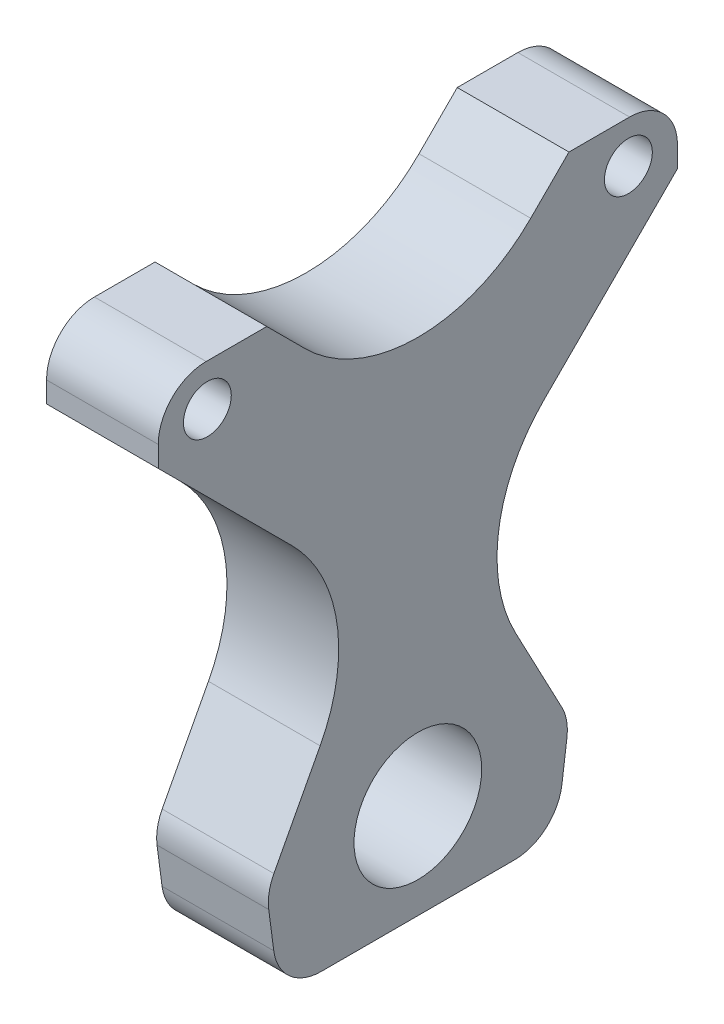
ISO-10303-21;
HEADER;
FILE_DESCRIPTION(('STEP AP214'),'2;1');
FILE_NAME('part.step','',(''),(''),'','','');
FILE_SCHEMA(('AUTOMOTIVE_DESIGN { 1 0 10303 214 1 1 1 1 }'));
ENDSEC;
DATA;
#1=APPLICATION_CONTEXT('core data for automotive mechanical design processes');
#2=APPLICATION_PROTOCOL_DEFINITION('international standard','automotive_design',2000,#1);
#3=PRODUCT_CONTEXT('',#1,'mechanical');
#4=PRODUCT('Part','Part','',(#3));
#5=PRODUCT_RELATED_PRODUCT_CATEGORY('part','',(#4));
#6=PRODUCT_DEFINITION_FORMATION('','',#4);
#7=PRODUCT_DEFINITION_CONTEXT('part definition',#1,'design');
#8=PRODUCT_DEFINITION('design','',#6,#7);
#9=PRODUCT_DEFINITION_SHAPE('','',#8);
#10=(LENGTH_UNIT() NAMED_UNIT(*) SI_UNIT(.MILLI.,.METRE.));
#11=(NAMED_UNIT(*) PLANE_ANGLE_UNIT() SI_UNIT($,.RADIAN.));
#12=(NAMED_UNIT(*) SI_UNIT($,.STERADIAN.) SOLID_ANGLE_UNIT());
#13=UNCERTAINTY_MEASURE_WITH_UNIT(LENGTH_MEASURE(1.E-05),#10,'distance_accuracy_value','');
#14=(GEOMETRIC_REPRESENTATION_CONTEXT(3) GLOBAL_UNCERTAINTY_ASSIGNED_CONTEXT((#13)) GLOBAL_UNIT_ASSIGNED_CONTEXT((#10,
#11,#12)) REPRESENTATION_CONTEXT('',''));
#15=CARTESIAN_POINT('',(0.,0.,0.));
#16=DIRECTION('',(0.,0.,1.));
#17=DIRECTION('',(1.,0.,0.));
#18=AXIS2_PLACEMENT_3D('',#15,#16,#17);
#19=CARTESIAN_POINT('',(7.,-4.37389583508979,14.9605392160996));
#20=DIRECTION('',(1.,0.,0.));
#21=DIRECTION('',(0.,0.,-1.));
#22=AXIS2_PLACEMENT_3D('',#19,#20,#21);
#23=PLANE('',#22);
#24=CARTESIAN_POINT('',(7.,12.7560030022119,-13.1893687729044));
#25=DIRECTION('',(1.,0.,0.));
#26=DIRECTION('',(0.,0.,1.));
#27=AXIS2_PLACEMENT_3D('',#24,#25,#26);
#28=CIRCLE('',#27,1.5);
#29=CARTESIAN_POINT('',(7.,12.7560030022119,-11.6893687729044));
#30=VERTEX_POINT('',#29);
#31=EDGE_CURVE('E415',#30,#30,#28,.T.);
#32=ORIENTED_EDGE('',*,*,#31,.F.);
#33=EDGE_LOOP('',(#32));
#34=FACE_BOUND('',#33,.T.);
#35=DIRECTION('',(0.,-1.,0.));
#36=VECTOR('',#35,1.);
#37=CARTESIAN_POINT('',(7.,12.3760907482895,16.2651639272319));
#38=LINE('',#37,#36);
#39=CARTESIAN_POINT('',(7.,12.3760907482895,16.2651639272319));
#40=VERTEX_POINT('',#39);
#41=CARTESIAN_POINT('',(7.,11.0728644997735,16.2651639272319));
#42=VERTEX_POINT('',#41);
#43=EDGE_CURVE('E256',#40,#42,#38,.T.);
#44=ORIENTED_EDGE('',*,*,#43,.T.);
#45=DIRECTION('',(0.,-0.707106781186548,-0.707106781186548));
#46=VECTOR('',#45,1.);
#47=CARTESIAN_POINT('',(7.,11.0728644997735,16.2651639272319));
#48=LINE('',#47,#46);
#49=CARTESIAN_POINT('',(7.,2.69717197677572,7.88947140423418));
#50=VERTEX_POINT('',#49);
#51=EDGE_CURVE('E134',#42,#50,#48,.T.);
#52=ORIENTED_EDGE('',*,*,#51,.T.);
#53=CARTESIAN_POINT('',(7.,-4.37389583508979,14.9605392160996));
#54=DIRECTION('',(-1.,0.,0.));
#55=DIRECTION('',(0.,0.,-1.));
#56=AXIS2_PLACEMENT_3D('',#53,#54,#55);
#57=CIRCLE('',#56,10.);
#58=CARTESIAN_POINT('',(7.,-9.04931443121883,6.12082989107255));
#59=VERTEX_POINT('',#58);
#60=EDGE_CURVE('E313',#50,#59,#57,.T.);
#61=ORIENTED_EDGE('',*,*,#60,.T.);
#62=DIRECTION('',(0.,-0.88397093250271,0.4675418596129));
#63=VECTOR('',#62,1.);
#64=CARTESIAN_POINT('',(7.,-9.04931443121884,6.12082989107255));
#65=LINE('',#64,#63);
#66=CARTESIAN_POINT('',(7.,-14.5305765505116,9.01992916012236));
#67=VERTEX_POINT('',#66);
#68=EDGE_CURVE('E332',#59,#67,#65,.T.);
#69=ORIENTED_EDGE('',*,*,#68,.T.);
#70=CARTESIAN_POINT('',(7.,-15.9332021293503,6.36801636261423));
#71=DIRECTION('',(1.,0.,0.));
#72=DIRECTION('',(0.,0.,1.));
#73=AXIS2_PLACEMENT_3D('',#70,#71,#72);
#74=CIRCLE('',#73,3.);
#75=CARTESIAN_POINT('',(7.,-16.324418470494,9.34239861350637));
#76=VERTEX_POINT('',#75);
#77=EDGE_CURVE('E329',#67,#76,#74,.T.);
#78=ORIENTED_EDGE('',*,*,#77,.T.);
#79=DIRECTION('',(0.,-0.991460750297379,-0.130405447047883));
#80=VECTOR('',#79,1.);
#81=CARTESIAN_POINT('',(7.,-16.324418470494,9.34239861350637));
#82=LINE('',#81,#80);
#83=CARTESIAN_POINT('',(7.,-18.7198312922111,9.02733331234689));
#84=VERTEX_POINT('',#83);
#85=EDGE_CURVE('E331',#76,#84,#82,.T.);
#86=ORIENTED_EDGE('',*,*,#85,.T.);
#87=CARTESIAN_POINT('',(7.,-18.3286149510674,6.05295106145475));
#88=DIRECTION('',(1.,0.,0.));
#89=DIRECTION('',(0.,0.,-1.));
#90=AXIS2_PLACEMENT_3D('',#87,#88,#89);
#91=CIRCLE('',#90,3.);
#92=CARTESIAN_POINT('',(7.,-21.3286149510674,6.05295106145473));
#93=VERTEX_POINT('',#92);
#94=EDGE_CURVE('E334',#84,#93,#91,.T.);
#95=ORIENTED_EDGE('',*,*,#94,.T.);
#96=DIRECTION('',(0.,0.,-1.));
#97=VECTOR('',#96,1.);
#98=CARTESIAN_POINT('',(7.,-21.3286149510674,6.05295106145473));
#99=LINE('',#98,#97);
#100=CARTESIAN_POINT('',(7.,-21.3286149510674,-6.05295106145474));
#101=VERTEX_POINT('',#100);
#102=EDGE_CURVE('E340',#93,#101,#99,.T.);
#103=ORIENTED_EDGE('',*,*,#102,.T.);
#104=CARTESIAN_POINT('',(7.,-18.3286149510674,-6.05295106145476));
#105=DIRECTION('',(1.,0.,0.));
#106=DIRECTION('',(0.,0.,1.));
#107=AXIS2_PLACEMENT_3D('',#104,#105,#106);
#108=CIRCLE('',#107,3.);
#109=CARTESIAN_POINT('',(7.,-18.7198312922111,-9.0273333123469));
#110=VERTEX_POINT('',#109);
#111=EDGE_CURVE('E342',#101,#110,#108,.T.);
#112=ORIENTED_EDGE('',*,*,#111,.T.);
#113=DIRECTION('',(0.,0.991460750297379,-0.130405447047884));
#114=VECTOR('',#113,1.);
#115=CARTESIAN_POINT('',(7.,-16.3244184704941,-9.34239861350636));
#116=LINE('',#115,#114);
#117=CARTESIAN_POINT('',(7.,-16.3244184704941,-9.34239861350636));
#118=VERTEX_POINT('',#117);
#119=EDGE_CURVE('E344',#110,#118,#116,.T.);
#120=ORIENTED_EDGE('',*,*,#119,.T.);
#121=CARTESIAN_POINT('',(7.,-15.9332021293503,-6.36801636261467));
#122=DIRECTION('',(1.,0.,0.));
#123=DIRECTION('',(0.,0.,1.));
#124=AXIS2_PLACEMENT_3D('',#121,#122,#123);
#125=CIRCLE('',#124,2.99999999999955);
#126=CARTESIAN_POINT('',(7.,-14.5305765505115,-9.01992916012225));
#127=VERTEX_POINT('',#126);
#128=EDGE_CURVE('E346',#118,#127,#125,.T.);
#129=ORIENTED_EDGE('',*,*,#128,.T.);
#130=DIRECTION('',(0.,0.88397093250271,0.467541859612901));
#131=VECTOR('',#130,1.);
#132=CARTESIAN_POINT('',(7.,-9.04931443121796,-6.12082989107199));
#133=LINE('',#132,#131);
#134=CARTESIAN_POINT('',(7.,-9.04931443121796,-6.12082989107199));
#135=VERTEX_POINT('',#134);
#136=EDGE_CURVE('E348',#127,#135,#133,.T.);
#137=ORIENTED_EDGE('',*,*,#136,.T.);
#138=CARTESIAN_POINT('',(7.,-4.37389583508888,-14.960539216099));
#139=DIRECTION('',(-1.,0.,0.));
#140=DIRECTION('',(0.,0.,1.));
#141=AXIS2_PLACEMENT_3D('',#138,#139,#140);
#142=CIRCLE('',#141,9.99999999999994);
#143=CARTESIAN_POINT('',(7.,2.69717197677666,-7.88947140423365));
#144=VERTEX_POINT('',#143);
#145=EDGE_CURVE('E350',#135,#144,#142,.T.);
#146=ORIENTED_EDGE('',*,*,#145,.T.);
#147=DIRECTION('',(0.,0.707106781186549,-0.707106781186546));
#148=VECTOR('',#147,1.);
#149=CARTESIAN_POINT('',(7.,11.0728644997743,-16.2651639272313));
#150=LINE('',#149,#148);
#151=CARTESIAN_POINT('',(7.,11.0728644997743,-16.2651639272313));
#152=VERTEX_POINT('',#151);
#153=EDGE_CURVE('E352',#144,#152,#150,.T.);
#154=ORIENTED_EDGE('',*,*,#153,.T.);
#155=DIRECTION('',(0.,1.,0.));
#156=VECTOR('',#155,1.);
#157=CARTESIAN_POINT('',(7.,12.3760907482897,-16.2651639272313));
#158=LINE('',#157,#156);
#159=CARTESIAN_POINT('',(7.,12.3760907482897,-16.2651639272313));
#160=VERTEX_POINT('',#159);
#161=EDGE_CURVE('E354',#152,#160,#158,.T.);
#162=ORIENTED_EDGE('',*,*,#161,.T.);
#163=CARTESIAN_POINT('',(7.,12.3760907482897,-13.2651639272313));
#164=DIRECTION('',(1.,0.,0.));
#165=DIRECTION('',(0.,0.,-1.));
#166=AXIS2_PLACEMENT_3D('',#163,#164,#165);
#167=CIRCLE('',#166,3.);
#168=CARTESIAN_POINT('',(7.,15.3760907482897,-13.2651639272313));
#169=VERTEX_POINT('',#168);
#170=EDGE_CURVE('E356',#160,#169,#167,.T.);
#171=ORIENTED_EDGE('',*,*,#170,.T.);
#172=DIRECTION('',(0.,0.,1.));
#173=VECTOR('',#172,1.);
#174=CARTESIAN_POINT('',(7.,15.3760907482897,-9.46713083364239));
#175=LINE('',#174,#173);
#176=CARTESIAN_POINT('',(7.,15.3760907482897,-9.46713083364239));
#177=VERTEX_POINT('',#176);
#178=EDGE_CURVE('E358',#169,#177,#175,.T.);
#179=ORIENTED_EDGE('',*,*,#178,.T.);
#180=DIRECTION('',(0.,-0.707106781186548,0.707106781186547));
#181=VECTOR('',#180,1.);
#182=CARTESIAN_POINT('',(7.,12.9800277265127,-7.07106781186544));
#183=LINE('',#182,#181);
#184=CARTESIAN_POINT('',(7.,12.9800277265127,-7.07106781186544));
#185=VERTEX_POINT('',#184);
#186=EDGE_CURVE('E360',#177,#185,#183,.T.);
#187=ORIENTED_EDGE('',*,*,#186,.T.);
#188=CARTESIAN_POINT('',(7.,20.0510955383781,0.));
#189=DIRECTION('',(-1.,0.,0.));
#190=DIRECTION('',(0.,0.,-1.));
#191=AXIS2_PLACEMENT_3D('',#188,#189,#190);
#192=CIRCLE('',#191,10.);
#193=CARTESIAN_POINT('',(7.,12.9800277265126,7.07106781186553));
#194=VERTEX_POINT('',#193);
#195=EDGE_CURVE('E195',#185,#194,#192,.T.);
#196=ORIENTED_EDGE('',*,*,#195,.T.);
#197=DIRECTION('',(0.,0.707106781186539,0.707106781186556));
#198=VECTOR('',#197,1.);
#199=CARTESIAN_POINT('',(7.,15.3760907482895,9.46713083364251));
#200=LINE('',#199,#198);
#201=CARTESIAN_POINT('',(7.,15.3760907482895,9.46713083364251));
#202=VERTEX_POINT('',#201);
#203=EDGE_CURVE('E189',#194,#202,#200,.T.);
#204=ORIENTED_EDGE('',*,*,#203,.T.);
#205=DIRECTION('',(0.,0.,1.));
#206=VECTOR('',#205,1.);
#207=CARTESIAN_POINT('',(7.,15.3760907482895,13.2651639272319));
#208=LINE('',#207,#206);
#209=CARTESIAN_POINT('',(7.,15.3760907482895,13.2651639272319));
#210=VERTEX_POINT('',#209);
#211=EDGE_CURVE('E193',#202,#210,#208,.T.);
#212=ORIENTED_EDGE('',*,*,#211,.T.);
#213=CARTESIAN_POINT('',(7.,12.3760907482895,13.2651639272319));
#214=DIRECTION('',(1.,0.,0.));
#215=DIRECTION('',(0.,0.,1.));
#216=AXIS2_PLACEMENT_3D('',#213,#214,#215);
#217=CIRCLE('',#216,3.);
#218=EDGE_CURVE('E49',#210,#40,#217,.T.);
#219=ORIENTED_EDGE('',*,*,#218,.T.);
#220=EDGE_LOOP('',(#44,#52,#61,#69,#78,#86,#95,#103,#112,#120,#129,#137,#146,#154,#162,#171,
#179,#187,#196,#204,#212,#219));
#221=FACE_BOUND('',#220,.T.);
#222=CARTESIAN_POINT('',(7.,12.7560030022119,13.1893687729044));
#223=DIRECTION('',(1.,0.,0.));
#224=DIRECTION('',(0.,0.,-1.));
#225=AXIS2_PLACEMENT_3D('',#222,#223,#224);
#226=CIRCLE('',#225,1.5);
#227=CARTESIAN_POINT('',(7.,12.7560030022119,11.6893687729044));
#228=VERTEX_POINT('',#227);
#229=EDGE_CURVE('E217',#228,#228,#226,.T.);
#230=ORIENTED_EDGE('',*,*,#229,.F.);
#231=EDGE_LOOP('',(#230));
#232=FACE_BOUND('',#231,.T.);
#233=CARTESIAN_POINT('',(7.,-15.3760907482891,0.));
#234=DIRECTION('',(1.,0.,0.));
#235=DIRECTION('',(0.,0.,-1.));
#236=AXIS2_PLACEMENT_3D('',#233,#234,#235);
#237=CIRCLE('',#236,4.);
#238=CARTESIAN_POINT('',(7.,-15.3760907482891,-4.));
#239=VERTEX_POINT('',#238);
#240=EDGE_CURVE('E406',#239,#239,#237,.T.);
#241=ORIENTED_EDGE('',*,*,#240,.F.);
#242=EDGE_LOOP('',(#241));
#243=FACE_BOUND('',#242,.T.);
#244=ADVANCED_FACE('F32',(#34,#221,#232,#243),#23,.T.);
#245=CARTESIAN_POINT('',(0.,-4.37389583508979,14.9605392160996));
#246=DIRECTION('',(1.,0.,0.));
#247=DIRECTION('',(0.,0.,-1.));
#248=AXIS2_PLACEMENT_3D('',#245,#246,#247);
#249=PLANE('',#248);
#250=DIRECTION('',(0.,-1.,0.));
#251=VECTOR('',#250,1.);
#252=CARTESIAN_POINT('',(0.,12.3760907482895,16.2651639272319));
#253=LINE('',#252,#251);
#254=CARTESIAN_POINT('',(0.,12.3760907482895,16.2651639272319));
#255=VERTEX_POINT('',#254);
#256=CARTESIAN_POINT('',(0.,11.0728644997735,16.2651639272319));
#257=VERTEX_POINT('',#256);
#258=EDGE_CURVE('E213',#255,#257,#253,.T.);
#259=ORIENTED_EDGE('',*,*,#258,.F.);
#260=CARTESIAN_POINT('',(0.,12.3760907482895,13.2651639272319));
#261=DIRECTION('',(1.,0.,0.));
#262=DIRECTION('',(0.,0.,1.));
#263=AXIS2_PLACEMENT_3D('',#260,#261,#262);
#264=CIRCLE('',#263,3.);
#265=CARTESIAN_POINT('',(0.,15.3760907482895,13.2651639272319));
#266=VERTEX_POINT('',#265);
#267=EDGE_CURVE('E126',#266,#255,#264,.T.);
#268=ORIENTED_EDGE('',*,*,#267,.F.);
#269=DIRECTION('',(0.,0.,1.));
#270=VECTOR('',#269,1.);
#271=CARTESIAN_POINT('',(0.,15.3760907482895,13.2651639272319));
#272=LINE('',#271,#270);
#273=CARTESIAN_POINT('',(0.,15.3760907482895,9.46713083364251));
#274=VERTEX_POINT('',#273);
#275=EDGE_CURVE('E120',#274,#266,#272,.T.);
#276=ORIENTED_EDGE('',*,*,#275,.F.);
#277=DIRECTION('',(0.,0.707106781186539,0.707106781186556));
#278=VECTOR('',#277,1.);
#279=CARTESIAN_POINT('',(0.,15.3760907482895,9.46713083364251));
#280=LINE('',#279,#278);
#281=CARTESIAN_POINT('',(0.,12.9800277265126,7.07106781186553));
#282=VERTEX_POINT('',#281);
#283=EDGE_CURVE('E203',#282,#274,#280,.T.);
#284=ORIENTED_EDGE('',*,*,#283,.F.);
#285=CARTESIAN_POINT('',(0.,20.0510955383781,0.));
#286=DIRECTION('',(-1.,0.,0.));
#287=DIRECTION('',(0.,0.,-1.));
#288=AXIS2_PLACEMENT_3D('',#285,#286,#287);
#289=CIRCLE('',#288,10.);
#290=CARTESIAN_POINT('',(0.,12.9800277265127,-7.07106781186544));
#291=VERTEX_POINT('',#290);
#292=EDGE_CURVE('E251',#291,#282,#289,.T.);
#293=ORIENTED_EDGE('',*,*,#292,.F.);
#294=DIRECTION('',(0.,-0.707106781186548,0.707106781186547));
#295=VECTOR('',#294,1.);
#296=CARTESIAN_POINT('',(0.,12.9800277265127,-7.07106781186544));
#297=LINE('',#296,#295);
#298=CARTESIAN_POINT('',(0.,15.3760907482897,-9.46713083364239));
#299=VERTEX_POINT('',#298);
#300=EDGE_CURVE('E249',#299,#291,#297,.T.);
#301=ORIENTED_EDGE('',*,*,#300,.F.);
#302=DIRECTION('',(0.,0.,1.));
#303=VECTOR('',#302,1.);
#304=CARTESIAN_POINT('',(0.,15.3760907482897,-9.46713083364239));
#305=LINE('',#304,#303);
#306=CARTESIAN_POINT('',(0.,15.3760907482897,-13.2651639272313));
#307=VERTEX_POINT('',#306);
#308=EDGE_CURVE('E247',#307,#299,#305,.T.);
#309=ORIENTED_EDGE('',*,*,#308,.F.);
#310=CARTESIAN_POINT('',(0.,12.3760907482897,-13.2651639272313));
#311=DIRECTION('',(1.,0.,0.));
#312=DIRECTION('',(0.,0.,-1.));
#313=AXIS2_PLACEMENT_3D('',#310,#311,#312);
#314=CIRCLE('',#313,3.);
#315=CARTESIAN_POINT('',(0.,12.3760907482897,-16.2651639272313));
#316=VERTEX_POINT('',#315);
#317=EDGE_CURVE('E245',#316,#307,#314,.T.);
#318=ORIENTED_EDGE('',*,*,#317,.F.);
#319=DIRECTION('',(0.,1.,0.));
#320=VECTOR('',#319,1.);
#321=CARTESIAN_POINT('',(0.,12.3760907482897,-16.2651639272313));
#322=LINE('',#321,#320);
#323=CARTESIAN_POINT('',(0.,11.0728644997743,-16.2651639272313));
#324=VERTEX_POINT('',#323);
#325=EDGE_CURVE('E243',#324,#316,#322,.T.);
#326=ORIENTED_EDGE('',*,*,#325,.F.);
#327=DIRECTION('',(0.,0.707106781186549,-0.707106781186546));
#328=VECTOR('',#327,1.);
#329=CARTESIAN_POINT('',(0.,11.0728644997743,-16.2651639272313));
#330=LINE('',#329,#328);
#331=CARTESIAN_POINT('',(0.,2.69717197677666,-7.88947140423365));
#332=VERTEX_POINT('',#331);
#333=EDGE_CURVE('E241',#332,#324,#330,.T.);
#334=ORIENTED_EDGE('',*,*,#333,.F.);
#335=CARTESIAN_POINT('',(0.,-4.37389583508888,-14.960539216099));
#336=DIRECTION('',(-1.,0.,0.));
#337=DIRECTION('',(0.,0.,1.));
#338=AXIS2_PLACEMENT_3D('',#335,#336,#337);
#339=CIRCLE('',#338,9.99999999999994);
#340=CARTESIAN_POINT('',(0.,-9.04931443121796,-6.12082989107199));
#341=VERTEX_POINT('',#340);
#342=EDGE_CURVE('E239',#341,#332,#339,.T.);
#343=ORIENTED_EDGE('',*,*,#342,.F.);
#344=DIRECTION('',(0.,0.88397093250271,0.467541859612901));
#345=VECTOR('',#344,1.);
#346=CARTESIAN_POINT('',(0.,-9.04931443121796,-6.12082989107199));
#347=LINE('',#346,#345);
#348=CARTESIAN_POINT('',(0.,-14.5305765505115,-9.01992916012225));
#349=VERTEX_POINT('',#348);
#350=EDGE_CURVE('E237',#349,#341,#347,.T.);
#351=ORIENTED_EDGE('',*,*,#350,.F.);
#352=CARTESIAN_POINT('',(0.,-15.9332021293503,-6.36801636261467));
#353=DIRECTION('',(1.,0.,0.));
#354=DIRECTION('',(0.,0.,1.));
#355=AXIS2_PLACEMENT_3D('',#352,#353,#354);
#356=CIRCLE('',#355,2.99999999999955);
#357=CARTESIAN_POINT('',(0.,-16.3244184704941,-9.34239861350636));
#358=VERTEX_POINT('',#357);
#359=EDGE_CURVE('E235',#358,#349,#356,.T.);
#360=ORIENTED_EDGE('',*,*,#359,.F.);
#361=DIRECTION('',(0.,0.991460750297379,-0.130405447047884));
#362=VECTOR('',#361,1.);
#363=CARTESIAN_POINT('',(0.,-16.3244184704941,-9.34239861350636));
#364=LINE('',#363,#362);
#365=CARTESIAN_POINT('',(0.,-18.7198312922111,-9.0273333123469));
#366=VERTEX_POINT('',#365);
#367=EDGE_CURVE('E233',#366,#358,#364,.T.);
#368=ORIENTED_EDGE('',*,*,#367,.F.);
#369=CARTESIAN_POINT('',(0.,-18.3286149510674,-6.05295106145476));
#370=DIRECTION('',(1.,0.,0.));
#371=DIRECTION('',(0.,0.,1.));
#372=AXIS2_PLACEMENT_3D('',#369,#370,#371);
#373=CIRCLE('',#372,3.);
#374=CARTESIAN_POINT('',(0.,-21.3286149510674,-6.05295106145474));
#375=VERTEX_POINT('',#374);
#376=EDGE_CURVE('E231',#375,#366,#373,.T.);
#377=ORIENTED_EDGE('',*,*,#376,.F.);
#378=DIRECTION('',(0.,0.,-1.));
#379=VECTOR('',#378,1.);
#380=CARTESIAN_POINT('',(0.,-21.3286149510674,6.05295106145473));
#381=LINE('',#380,#379);
#382=CARTESIAN_POINT('',(0.,-21.3286149510674,6.05295106145473));
#383=VERTEX_POINT('',#382);
#384=EDGE_CURVE('E229',#383,#375,#381,.T.);
#385=ORIENTED_EDGE('',*,*,#384,.F.);
#386=CARTESIAN_POINT('',(0.,-18.3286149510674,6.05295106145475));
#387=DIRECTION('',(1.,0.,0.));
#388=DIRECTION('',(0.,0.,-1.));
#389=AXIS2_PLACEMENT_3D('',#386,#387,#388);
#390=CIRCLE('',#389,3.);
#391=CARTESIAN_POINT('',(0.,-18.7198312922111,9.02733331234689));
#392=VERTEX_POINT('',#391);
#393=EDGE_CURVE('E227',#392,#383,#390,.T.);
#394=ORIENTED_EDGE('',*,*,#393,.F.);
#395=DIRECTION('',(0.,-0.991460750297379,-0.130405447047883));
#396=VECTOR('',#395,1.);
#397=CARTESIAN_POINT('',(0.,-16.324418470494,9.34239861350637));
#398=LINE('',#397,#396);
#399=CARTESIAN_POINT('',(0.,-16.324418470494,9.34239861350637));
#400=VERTEX_POINT('',#399);
#401=EDGE_CURVE('E225',#400,#392,#398,.T.);
#402=ORIENTED_EDGE('',*,*,#401,.F.);
#403=CARTESIAN_POINT('',(0.,-15.9332021293503,6.36801636261423));
#404=DIRECTION('',(1.,0.,0.));
#405=DIRECTION('',(0.,0.,1.));
#406=AXIS2_PLACEMENT_3D('',#403,#404,#405);
#407=CIRCLE('',#406,3.);
#408=CARTESIAN_POINT('',(0.,-14.5305765505116,9.01992916012236));
#409=VERTEX_POINT('',#408);
#410=EDGE_CURVE('E223',#409,#400,#407,.T.);
#411=ORIENTED_EDGE('',*,*,#410,.F.);
#412=DIRECTION('',(0.,-0.88397093250271,0.4675418596129));
#413=VECTOR('',#412,1.);
#414=CARTESIAN_POINT('',(0.,-9.04931443121884,6.12082989107255));
#415=LINE('',#414,#413);
#416=CARTESIAN_POINT('',(0.,-9.04931443121883,6.12082989107255));
#417=VERTEX_POINT('',#416);
#418=EDGE_CURVE('E221',#417,#409,#415,.T.);
#419=ORIENTED_EDGE('',*,*,#418,.F.);
#420=CARTESIAN_POINT('',(0.,-4.37389583508979,14.9605392160996));
#421=DIRECTION('',(-1.,0.,0.));
#422=DIRECTION('',(0.,0.,-1.));
#423=AXIS2_PLACEMENT_3D('',#420,#421,#422);
#424=CIRCLE('',#423,10.);
#425=CARTESIAN_POINT('',(0.,2.69717197677572,7.88947140423418));
#426=VERTEX_POINT('',#425);
#427=EDGE_CURVE('E219',#426,#417,#424,.T.);
#428=ORIENTED_EDGE('',*,*,#427,.F.);
#429=DIRECTION('',(0.,-0.707106781186548,-0.707106781186548));
#430=VECTOR('',#429,1.);
#431=CARTESIAN_POINT('',(0.,11.0728644997735,16.2651639272319));
#432=LINE('',#431,#430);
#433=EDGE_CURVE('E216',#257,#426,#432,.T.);
#434=ORIENTED_EDGE('',*,*,#433,.F.);
#435=EDGE_LOOP('',(#259,#268,#276,#284,#293,#301,#309,#318,#326,#334,#343,#351,#360,#368,#377,
#385,#394,#402,#411,#419,#428,#434));
#436=FACE_BOUND('',#435,.T.);
#437=CARTESIAN_POINT('',(0.,12.7560030022119,13.1893687729044));
#438=DIRECTION('',(1.,0.,0.));
#439=DIRECTION('',(0.,0.,-1.));
#440=AXIS2_PLACEMENT_3D('',#437,#438,#439);
#441=CIRCLE('',#440,1.5);
#442=CARTESIAN_POINT('',(0.,12.7560030022119,11.6893687729044));
#443=VERTEX_POINT('',#442);
#444=EDGE_CURVE('E418',#443,#443,#441,.T.);
#445=ORIENTED_EDGE('',*,*,#444,.T.);
#446=EDGE_LOOP('',(#445));
#447=FACE_BOUND('',#446,.T.);
#448=CARTESIAN_POINT('',(0.,12.7560030022119,-13.1893687729044));
#449=DIRECTION('',(1.,0.,0.));
#450=DIRECTION('',(0.,0.,1.));
#451=AXIS2_PLACEMENT_3D('',#448,#449,#450);
#452=CIRCLE('',#451,1.5);
#453=CARTESIAN_POINT('',(0.,12.7560030022119,-11.6893687729044));
#454=VERTEX_POINT('',#453);
#455=EDGE_CURVE('E412',#454,#454,#452,.T.);
#456=ORIENTED_EDGE('',*,*,#455,.T.);
#457=EDGE_LOOP('',(#456));
#458=FACE_BOUND('',#457,.T.);
#459=CARTESIAN_POINT('',(0.,-15.3760907482891,0.));
#460=DIRECTION('',(1.,0.,0.));
#461=DIRECTION('',(0.,0.,-1.));
#462=AXIS2_PLACEMENT_3D('',#459,#460,#461);
#463=CIRCLE('',#462,4.);
#464=CARTESIAN_POINT('',(0.,-15.3760907482891,-4.));
#465=VERTEX_POINT('',#464);
#466=EDGE_CURVE('E409',#465,#465,#463,.T.);
#467=ORIENTED_EDGE('',*,*,#466,.T.);
#468=EDGE_LOOP('',(#467));
#469=FACE_BOUND('',#468,.T.);
#470=ADVANCED_FACE('F317',(#436,#447,#458,#469),#249,.F.);
#471=CARTESIAN_POINT('',(7.,12.3760907482895,16.2651639272319));
#472=DIRECTION('',(0.,0.,-1.));
#473=DIRECTION('',(-1.,0.,0.));
#474=AXIS2_PLACEMENT_3D('',#471,#472,#473);
#475=PLANE('',#474);
#476=ORIENTED_EDGE('',*,*,#258,.T.);
#477=DIRECTION('',(-1.,0.,0.));
#478=VECTOR('',#477,1.);
#479=CARTESIAN_POINT('',(7.,11.0728644997735,16.2651639272319));
#480=LINE('',#479,#478);
#481=EDGE_CURVE('E11',#42,#257,#480,.T.);
#482=ORIENTED_EDGE('',*,*,#481,.F.);
#483=ORIENTED_EDGE('',*,*,#43,.F.);
#484=DIRECTION('',(-1.,0.,0.));
#485=VECTOR('',#484,1.);
#486=CARTESIAN_POINT('',(7.,12.3760907482895,16.2651639272319));
#487=LINE('',#486,#485);
#488=EDGE_CURVE('E209',#40,#255,#487,.T.);
#489=ORIENTED_EDGE('',*,*,#488,.T.);
#490=EDGE_LOOP('',(#476,#482,#483,#489));
#491=FACE_BOUND('',#490,.T.);
#492=ADVANCED_FACE('F34',(#491),#475,.F.);
#493=CARTESIAN_POINT('',(7.,11.0728644997735,16.2651639272319));
#494=DIRECTION('',(0.,0.707106781186547,-0.707106781186547));
#495=DIRECTION('',(0.,0.707106781186548,0.707106781186548));
#496=AXIS2_PLACEMENT_3D('',#493,#494,#495);
#497=PLANE('',#496);
#498=ORIENTED_EDGE('',*,*,#433,.T.);
#499=DIRECTION('',(-1.,0.,0.));
#500=VECTOR('',#499,1.);
#501=CARTESIAN_POINT('',(7.,2.69717197677572,7.88947140423418));
#502=LINE('',#501,#500);
#503=EDGE_CURVE('E41',#50,#426,#502,.T.);
#504=ORIENTED_EDGE('',*,*,#503,.F.);
#505=ORIENTED_EDGE('',*,*,#51,.F.);
#506=ORIENTED_EDGE('',*,*,#481,.T.);
#507=EDGE_LOOP('',(#498,#504,#505,#506));
#508=FACE_BOUND('',#507,.T.);
#509=ADVANCED_FACE('F620',(#508),#497,.F.);
#510=CARTESIAN_POINT('',(7.,-4.37389583508979,14.9605392160996));
#511=DIRECTION('',(-1.,0.,0.));
#512=DIRECTION('',(0.,0.,1.));
#513=AXIS2_PLACEMENT_3D('',#510,#511,#512);
#514=CYLINDRICAL_SURFACE('',#513,10.);
#515=ORIENTED_EDGE('',*,*,#427,.T.);
#516=DIRECTION('',(-1.,0.,0.));
#517=VECTOR('',#516,1.);
#518=CARTESIAN_POINT('',(7.,-9.04931443121883,6.12082989107255));
#519=LINE('',#518,#517);
#520=EDGE_CURVE('E305',#59,#417,#519,.T.);
#521=ORIENTED_EDGE('',*,*,#520,.F.);
#522=ORIENTED_EDGE('',*,*,#60,.F.);
#523=ORIENTED_EDGE('',*,*,#503,.T.);
#524=EDGE_LOOP('',(#515,#521,#522,#523));
#525=FACE_BOUND('',#524,.T.);
#526=ADVANCED_FACE('F311',(#525),#514,.F.);
#527=CARTESIAN_POINT('',(7.,-9.04931443121884,6.12082989107255));
#528=DIRECTION('',(0.,-0.4675418596129,-0.88397093250271));
#529=DIRECTION('',(0.,0.88397093250271,-0.4675418596129));
#530=AXIS2_PLACEMENT_3D('',#527,#528,#529);
#531=PLANE('',#530);
#532=ORIENTED_EDGE('',*,*,#418,.T.);
#533=DIRECTION('',(-1.,0.,0.));
#534=VECTOR('',#533,1.);
#535=CARTESIAN_POINT('',(7.,-14.5305765505116,9.01992916012236));
#536=LINE('',#535,#534);
#537=EDGE_CURVE('E302',#67,#409,#536,.T.);
#538=ORIENTED_EDGE('',*,*,#537,.F.);
#539=ORIENTED_EDGE('',*,*,#68,.F.);
#540=ORIENTED_EDGE('',*,*,#520,.T.);
#541=EDGE_LOOP('',(#532,#538,#539,#540));
#542=FACE_BOUND('',#541,.T.);
#543=ADVANCED_FACE('F323',(#542),#531,.F.);
#544=CARTESIAN_POINT('',(7.,-15.9332021293503,6.36801636261423));
#545=DIRECTION('',(-1.,0.,0.));
#546=DIRECTION('',(0.,0.,1.));
#547=AXIS2_PLACEMENT_3D('',#544,#545,#546);
#548=CYLINDRICAL_SURFACE('',#547,3.);
#549=ORIENTED_EDGE('',*,*,#410,.T.);
#550=DIRECTION('',(-1.,0.,0.));
#551=VECTOR('',#550,1.);
#552=CARTESIAN_POINT('',(7.,-16.324418470494,9.34239861350637));
#553=LINE('',#552,#551);
#554=EDGE_CURVE('E299',#76,#400,#553,.T.);
#555=ORIENTED_EDGE('',*,*,#554,.F.);
#556=ORIENTED_EDGE('',*,*,#77,.F.);
#557=ORIENTED_EDGE('',*,*,#537,.T.);
#558=EDGE_LOOP('',(#549,#555,#556,#557));
#559=FACE_BOUND('',#558,.T.);
#560=ADVANCED_FACE('F327',(#559),#548,.T.);
#561=CARTESIAN_POINT('',(7.,-16.324418470494,9.34239861350637));
#562=DIRECTION('',(0.,0.130405447047883,-0.991460750297379));
#563=DIRECTION('',(0.,0.991460750297379,0.130405447047883));
#564=AXIS2_PLACEMENT_3D('',#561,#562,#563);
#565=PLANE('',#564);
#566=ORIENTED_EDGE('',*,*,#401,.T.);
#567=DIRECTION('',(-1.,0.,0.));
#568=VECTOR('',#567,1.);
#569=CARTESIAN_POINT('',(7.,-18.7198312922111,9.02733331234689));
#570=LINE('',#569,#568);
#571=EDGE_CURVE('E296',#84,#392,#570,.T.);
#572=ORIENTED_EDGE('',*,*,#571,.F.);
#573=ORIENTED_EDGE('',*,*,#85,.F.);
#574=ORIENTED_EDGE('',*,*,#554,.T.);
#575=EDGE_LOOP('',(#566,#572,#573,#574));
#576=FACE_BOUND('',#575,.T.);
#577=ADVANCED_FACE('F585',(#576),#565,.F.);
#578=CARTESIAN_POINT('',(7.,-18.3286149510674,6.05295106145475));
#579=DIRECTION('',(-1.,0.,0.));
#580=DIRECTION('',(0.,0.,1.));
#581=AXIS2_PLACEMENT_3D('',#578,#579,#580);
#582=CYLINDRICAL_SURFACE('',#581,3.);
#583=ORIENTED_EDGE('',*,*,#393,.T.);
#584=DIRECTION('',(-1.,0.,0.));
#585=VECTOR('',#584,1.);
#586=CARTESIAN_POINT('',(7.,-21.3286149510674,6.05295106145473));
#587=LINE('',#586,#585);
#588=EDGE_CURVE('E293',#93,#383,#587,.T.);
#589=ORIENTED_EDGE('',*,*,#588,.F.);
#590=ORIENTED_EDGE('',*,*,#94,.F.);
#591=ORIENTED_EDGE('',*,*,#571,.T.);
#592=EDGE_LOOP('',(#583,#589,#590,#591));
#593=FACE_BOUND('',#592,.T.);
#594=ADVANCED_FACE('F575',(#593),#582,.T.);
#595=CARTESIAN_POINT('',(7.,-21.3286149510674,6.05295106145473));
#596=DIRECTION('',(0.,1.,0.));
#597=DIRECTION('',(0.,0.,1.));
#598=AXIS2_PLACEMENT_3D('',#595,#596,#597);
#599=PLANE('',#598);
#600=ORIENTED_EDGE('',*,*,#384,.T.);
#601=DIRECTION('',(-1.,0.,0.));
#602=VECTOR('',#601,1.);
#603=CARTESIAN_POINT('',(7.,-21.3286149510674,-6.05295106145474));
#604=LINE('',#603,#602);
#605=EDGE_CURVE('E290',#101,#375,#604,.T.);
#606=ORIENTED_EDGE('',*,*,#605,.F.);
#607=ORIENTED_EDGE('',*,*,#102,.F.);
#608=ORIENTED_EDGE('',*,*,#588,.T.);
#609=EDGE_LOOP('',(#600,#606,#607,#608));
#610=FACE_BOUND('',#609,.T.);
#611=ADVANCED_FACE('F565',(#610),#599,.F.);
#612=CARTESIAN_POINT('',(7.,-18.3286149510674,-6.05295106145476));
#613=DIRECTION('',(-1.,0.,0.));
#614=DIRECTION('',(0.,0.,1.));
#615=AXIS2_PLACEMENT_3D('',#612,#613,#614);
#616=CYLINDRICAL_SURFACE('',#615,3.);
#617=ORIENTED_EDGE('',*,*,#376,.T.);
#618=DIRECTION('',(-1.,0.,0.));
#619=VECTOR('',#618,1.);
#620=CARTESIAN_POINT('',(7.,-18.7198312922111,-9.0273333123469));
#621=LINE('',#620,#619);
#622=EDGE_CURVE('E287',#110,#366,#621,.T.);
#623=ORIENTED_EDGE('',*,*,#622,.F.);
#624=ORIENTED_EDGE('',*,*,#111,.F.);
#625=ORIENTED_EDGE('',*,*,#605,.T.);
#626=EDGE_LOOP('',(#617,#623,#624,#625));
#627=FACE_BOUND('',#626,.T.);
#628=ADVANCED_FACE('F555',(#627),#616,.T.);
#629=CARTESIAN_POINT('',(7.,-16.3244184704941,-9.34239861350636));
#630=DIRECTION('',(0.,0.130405447047884,0.991460750297379));
#631=DIRECTION('',(0.,-0.991460750297379,0.130405447047884));
#632=AXIS2_PLACEMENT_3D('',#629,#630,#631);
#633=PLANE('',#632);
#634=ORIENTED_EDGE('',*,*,#367,.T.);
#635=DIRECTION('',(-1.,0.,0.));
#636=VECTOR('',#635,1.);
#637=CARTESIAN_POINT('',(7.,-16.3244184704941,-9.34239861350636));
#638=LINE('',#637,#636);
#639=EDGE_CURVE('E284',#118,#358,#638,.T.);
#640=ORIENTED_EDGE('',*,*,#639,.F.);
#641=ORIENTED_EDGE('',*,*,#119,.F.);
#642=ORIENTED_EDGE('',*,*,#622,.T.);
#643=EDGE_LOOP('',(#634,#640,#641,#642));
#644=FACE_BOUND('',#643,.T.);
#645=ADVANCED_FACE('F545',(#644),#633,.F.);
#646=CARTESIAN_POINT('',(7.,-15.9332021293503,-6.36801636261467));
#647=DIRECTION('',(-1.,0.,0.));
#648=DIRECTION('',(0.,0.,1.));
#649=AXIS2_PLACEMENT_3D('',#646,#647,#648);
#650=CYLINDRICAL_SURFACE('',#649,2.99999999999955);
#651=ORIENTED_EDGE('',*,*,#359,.T.);
#652=DIRECTION('',(-1.,0.,0.));
#653=VECTOR('',#652,1.);
#654=CARTESIAN_POINT('',(7.,-14.5305765505115,-9.01992916012225));
#655=LINE('',#654,#653);
#656=EDGE_CURVE('E281',#127,#349,#655,.T.);
#657=ORIENTED_EDGE('',*,*,#656,.F.);
#658=ORIENTED_EDGE('',*,*,#128,.F.);
#659=ORIENTED_EDGE('',*,*,#639,.T.);
#660=EDGE_LOOP('',(#651,#657,#658,#659));
#661=FACE_BOUND('',#660,.T.);
#662=ADVANCED_FACE('F535',(#661),#650,.T.);
#663=CARTESIAN_POINT('',(7.,-9.04931443121796,-6.12082989107199));
#664=DIRECTION('',(0.,-0.467541859612901,0.88397093250271));
#665=DIRECTION('',(0.,-0.88397093250271,-0.467541859612901));
#666=AXIS2_PLACEMENT_3D('',#663,#664,#665);
#667=PLANE('',#666);
#668=ORIENTED_EDGE('',*,*,#350,.T.);
#669=DIRECTION('',(-1.,0.,0.));
#670=VECTOR('',#669,1.);
#671=CARTESIAN_POINT('',(7.,-9.04931443121796,-6.12082989107199));
#672=LINE('',#671,#670);
#673=EDGE_CURVE('E278',#135,#341,#672,.T.);
#674=ORIENTED_EDGE('',*,*,#673,.F.);
#675=ORIENTED_EDGE('',*,*,#136,.F.);
#676=ORIENTED_EDGE('',*,*,#656,.T.);
#677=EDGE_LOOP('',(#668,#674,#675,#676));
#678=FACE_BOUND('',#677,.T.);
#679=ADVANCED_FACE('F525',(#678),#667,.F.);
#680=CARTESIAN_POINT('',(7.,-4.37389583508888,-14.960539216099));
#681=DIRECTION('',(-1.,0.,0.));
#682=DIRECTION('',(0.,0.,1.));
#683=AXIS2_PLACEMENT_3D('',#680,#681,#682);
#684=CYLINDRICAL_SURFACE('',#683,9.99999999999994);
#685=ORIENTED_EDGE('',*,*,#342,.T.);
#686=DIRECTION('',(-1.,0.,0.));
#687=VECTOR('',#686,1.);
#688=CARTESIAN_POINT('',(7.,2.69717197677666,-7.88947140423365));
#689=LINE('',#688,#687);
#690=EDGE_CURVE('E275',#144,#332,#689,.T.);
#691=ORIENTED_EDGE('',*,*,#690,.F.);
#692=ORIENTED_EDGE('',*,*,#145,.F.);
#693=ORIENTED_EDGE('',*,*,#673,.T.);
#694=EDGE_LOOP('',(#685,#691,#692,#693));
#695=FACE_BOUND('',#694,.T.);
#696=ADVANCED_FACE('F515',(#695),#684,.F.);
#697=CARTESIAN_POINT('',(7.,11.0728644997743,-16.2651639272313));
#698=DIRECTION('',(0.,0.707106781186546,0.707106781186549));
#699=DIRECTION('',(0.,-0.707106781186549,0.707106781186546));
#700=AXIS2_PLACEMENT_3D('',#697,#698,#699);
#701=PLANE('',#700);
#702=ORIENTED_EDGE('',*,*,#333,.T.);
#703=DIRECTION('',(-1.,0.,0.));
#704=VECTOR('',#703,1.);
#705=CARTESIAN_POINT('',(7.,11.0728644997743,-16.2651639272313));
#706=LINE('',#705,#704);
#707=EDGE_CURVE('E272',#152,#324,#706,.T.);
#708=ORIENTED_EDGE('',*,*,#707,.F.);
#709=ORIENTED_EDGE('',*,*,#153,.F.);
#710=ORIENTED_EDGE('',*,*,#690,.T.);
#711=EDGE_LOOP('',(#702,#708,#709,#710));
#712=FACE_BOUND('',#711,.T.);
#713=ADVANCED_FACE('F505',(#712),#701,.F.);
#714=CARTESIAN_POINT('',(7.,12.3760907482897,-16.2651639272313));
#715=DIRECTION('',(0.,0.,1.));
#716=DIRECTION('',(0.,-1.,0.));
#717=AXIS2_PLACEMENT_3D('',#714,#715,#716);
#718=PLANE('',#717);
#719=ORIENTED_EDGE('',*,*,#325,.T.);
#720=DIRECTION('',(-1.,0.,0.));
#721=VECTOR('',#720,1.);
#722=CARTESIAN_POINT('',(7.,12.3760907482897,-16.2651639272313));
#723=LINE('',#722,#721);
#724=EDGE_CURVE('E269',#160,#316,#723,.T.);
#725=ORIENTED_EDGE('',*,*,#724,.F.);
#726=ORIENTED_EDGE('',*,*,#161,.F.);
#727=ORIENTED_EDGE('',*,*,#707,.T.);
#728=EDGE_LOOP('',(#719,#725,#726,#727));
#729=FACE_BOUND('',#728,.T.);
#730=ADVANCED_FACE('F495',(#729),#718,.F.);
#731=CARTESIAN_POINT('',(7.,12.3760907482897,-13.2651639272313));
#732=DIRECTION('',(-1.,0.,0.));
#733=DIRECTION('',(0.,0.,1.));
#734=AXIS2_PLACEMENT_3D('',#731,#732,#733);
#735=CYLINDRICAL_SURFACE('',#734,3.);
#736=ORIENTED_EDGE('',*,*,#317,.T.);
#737=DIRECTION('',(-1.,0.,0.));
#738=VECTOR('',#737,1.);
#739=CARTESIAN_POINT('',(7.,15.3760907482897,-13.2651639272313));
#740=LINE('',#739,#738);
#741=EDGE_CURVE('E266',#169,#307,#740,.T.);
#742=ORIENTED_EDGE('',*,*,#741,.F.);
#743=ORIENTED_EDGE('',*,*,#170,.F.);
#744=ORIENTED_EDGE('',*,*,#724,.T.);
#745=EDGE_LOOP('',(#736,#742,#743,#744));
#746=FACE_BOUND('',#745,.T.);
#747=ADVANCED_FACE('F485',(#746),#735,.T.);
#748=CARTESIAN_POINT('',(7.,15.3760907482897,-9.46713083364239));
#749=DIRECTION('',(0.,-1.,0.));
#750=DIRECTION('',(0.,0.,-1.));
#751=AXIS2_PLACEMENT_3D('',#748,#749,#750);
#752=PLANE('',#751);
#753=ORIENTED_EDGE('',*,*,#308,.T.);
#754=DIRECTION('',(-1.,0.,0.));
#755=VECTOR('',#754,1.);
#756=CARTESIAN_POINT('',(7.,15.3760907482897,-9.46713083364239));
#757=LINE('',#756,#755);
#758=EDGE_CURVE('E263',#177,#299,#757,.T.);
#759=ORIENTED_EDGE('',*,*,#758,.F.);
#760=ORIENTED_EDGE('',*,*,#178,.F.);
#761=ORIENTED_EDGE('',*,*,#741,.T.);
#762=EDGE_LOOP('',(#753,#759,#760,#761));
#763=FACE_BOUND('',#762,.T.);
#764=ADVANCED_FACE('F476',(#763),#752,.F.);
#765=CARTESIAN_POINT('',(7.,12.9800277265127,-7.07106781186544));
#766=DIRECTION('',(0.,-0.707106781186547,-0.707106781186548));
#767=DIRECTION('',(0.,0.707106781186548,-0.707106781186547));
#768=AXIS2_PLACEMENT_3D('',#765,#766,#767);
#769=PLANE('',#768);
#770=ORIENTED_EDGE('',*,*,#300,.T.);
#771=DIRECTION('',(-1.,0.,0.));
#772=VECTOR('',#771,1.);
#773=CARTESIAN_POINT('',(7.,12.9800277265127,-7.07106781186544));
#774=LINE('',#773,#772);
#775=EDGE_CURVE('E260',#185,#291,#774,.T.);
#776=ORIENTED_EDGE('',*,*,#775,.F.);
#777=ORIENTED_EDGE('',*,*,#186,.F.);
#778=ORIENTED_EDGE('',*,*,#758,.T.);
#779=EDGE_LOOP('',(#770,#776,#777,#778));
#780=FACE_BOUND('',#779,.T.);
#781=ADVANCED_FACE('F366',(#780),#769,.F.);
#782=CARTESIAN_POINT('',(7.,20.0510955383781,0.));
#783=DIRECTION('',(-1.,0.,0.));
#784=DIRECTION('',(0.,0.,1.));
#785=AXIS2_PLACEMENT_3D('',#782,#783,#784);
#786=CYLINDRICAL_SURFACE('',#785,10.);
#787=ORIENTED_EDGE('',*,*,#292,.T.);
#788=DIRECTION('',(-1.,0.,0.));
#789=VECTOR('',#788,1.);
#790=CARTESIAN_POINT('',(7.,12.9800277265126,7.07106781186553));
#791=LINE('',#790,#789);
#792=EDGE_CURVE('E204',#194,#282,#791,.T.);
#793=ORIENTED_EDGE('',*,*,#792,.F.);
#794=ORIENTED_EDGE('',*,*,#195,.F.);
#795=ORIENTED_EDGE('',*,*,#775,.T.);
#796=EDGE_LOOP('',(#787,#793,#794,#795));
#797=FACE_BOUND('',#796,.T.);
#798=ADVANCED_FACE('F370',(#797),#786,.F.);
#799=CARTESIAN_POINT('',(7.,15.3760907482895,9.46713083364251));
#800=DIRECTION('',(0.,-0.707106781186556,0.707106781186539));
#801=DIRECTION('',(0.,-0.707106781186539,-0.707106781186556));
#802=AXIS2_PLACEMENT_3D('',#799,#800,#801);
#803=PLANE('',#802);
#804=ORIENTED_EDGE('',*,*,#283,.T.);
#805=DIRECTION('',(-1.,0.,0.));
#806=VECTOR('',#805,1.);
#807=CARTESIAN_POINT('',(7.,15.3760907482895,9.46713083364251));
#808=LINE('',#807,#806);
#809=EDGE_CURVE('E200',#202,#274,#808,.T.);
#810=ORIENTED_EDGE('',*,*,#809,.F.);
#811=ORIENTED_EDGE('',*,*,#203,.F.);
#812=ORIENTED_EDGE('',*,*,#792,.T.);
#813=EDGE_LOOP('',(#804,#810,#811,#812));
#814=FACE_BOUND('',#813,.T.);
#815=ADVANCED_FACE('F201',(#814),#803,.F.);
#816=CARTESIAN_POINT('',(7.,15.3760907482895,13.2651639272319));
#817=DIRECTION('',(0.,-1.,0.));
#818=DIRECTION('',(0.,0.,-1.));
#819=AXIS2_PLACEMENT_3D('',#816,#817,#818);
#820=PLANE('',#819);
#821=ORIENTED_EDGE('',*,*,#275,.T.);
#822=DIRECTION('',(-1.,0.,0.));
#823=VECTOR('',#822,1.);
#824=CARTESIAN_POINT('',(7.,15.3760907482895,13.2651639272319));
#825=LINE('',#824,#823);
#826=EDGE_CURVE('E205',#210,#266,#825,.T.);
#827=ORIENTED_EDGE('',*,*,#826,.F.);
#828=ORIENTED_EDGE('',*,*,#211,.F.);
#829=ORIENTED_EDGE('',*,*,#809,.T.);
#830=EDGE_LOOP('',(#821,#827,#828,#829));
#831=FACE_BOUND('',#830,.T.);
#832=ADVANCED_FACE('F207',(#831),#820,.F.);
#833=CARTESIAN_POINT('',(7.,12.3760907482895,13.2651639272319));
#834=DIRECTION('',(-1.,0.,0.));
#835=DIRECTION('',(0.,0.,1.));
#836=AXIS2_PLACEMENT_3D('',#833,#834,#835);
#837=CYLINDRICAL_SURFACE('',#836,3.);
#838=ORIENTED_EDGE('',*,*,#267,.T.);
#839=ORIENTED_EDGE('',*,*,#488,.F.);
#840=ORIENTED_EDGE('',*,*,#218,.F.);
#841=ORIENTED_EDGE('',*,*,#826,.T.);
#842=EDGE_LOOP('',(#838,#839,#840,#841));
#843=FACE_BOUND('',#842,.T.);
#844=ADVANCED_FACE('F374',(#843),#837,.T.);
#845=CARTESIAN_POINT('',(7.,12.7560030022119,13.1893687729044));
#846=DIRECTION('',(-1.,0.,0.));
#847=DIRECTION('',(0.,0.,1.));
#848=AXIS2_PLACEMENT_3D('',#845,#846,#847);
#849=CYLINDRICAL_SURFACE('',#848,1.5);
#850=ORIENTED_EDGE('',*,*,#229,.T.);
#851=EDGE_LOOP('',(#850));
#852=FACE_BOUND('',#851,.T.);
#853=ORIENTED_EDGE('',*,*,#444,.F.);
#854=EDGE_LOOP('',(#853));
#855=FACE_BOUND('',#854,.T.);
#856=ADVANCED_FACE('F376',(#852,#855),#849,.F.);
#857=CARTESIAN_POINT('',(7.,12.7560030022119,-13.1893687729044));
#858=DIRECTION('',(-1.,0.,0.));
#859=DIRECTION('',(0.,0.,1.));
#860=AXIS2_PLACEMENT_3D('',#857,#858,#859);
#861=CYLINDRICAL_SURFACE('',#860,1.5);
#862=ORIENTED_EDGE('',*,*,#31,.T.);
#863=EDGE_LOOP('',(#862));
#864=FACE_BOUND('',#863,.T.);
#865=ORIENTED_EDGE('',*,*,#455,.F.);
#866=EDGE_LOOP('',(#865));
#867=FACE_BOUND('',#866,.T.);
#868=ADVANCED_FACE('F382',(#864,#867),#861,.F.);
#869=CARTESIAN_POINT('',(7.,-15.3760907482891,0.));
#870=DIRECTION('',(-1.,0.,0.));
#871=DIRECTION('',(0.,0.,1.));
#872=AXIS2_PLACEMENT_3D('',#869,#870,#871);
#873=CYLINDRICAL_SURFACE('',#872,4.);
#874=ORIENTED_EDGE('',*,*,#240,.T.);
#875=EDGE_LOOP('',(#874));
#876=FACE_BOUND('',#875,.T.);
#877=ORIENTED_EDGE('',*,*,#466,.F.);
#878=EDGE_LOOP('',(#877));
#879=FACE_BOUND('',#878,.T.);
#880=ADVANCED_FACE('F397',(#876,#879),#873,.F.);
#881=CLOSED_SHELL('',(#244,#470,#492,#509,#526,#543,#560,#577,#594,#611,#628,#645,#662,#679,
#696,#713,#730,#747,#764,#781,#798,#815,#832,#844,#856,#868,#880));
#882=MANIFOLD_SOLID_BREP('B2',#881);
#883=ADVANCED_BREP_SHAPE_REPRESENTATION('',(#18,#882),#14);
#884=SHAPE_DEFINITION_REPRESENTATION(#9,#883);
ENDSEC;
END-ISO-10303-21;
